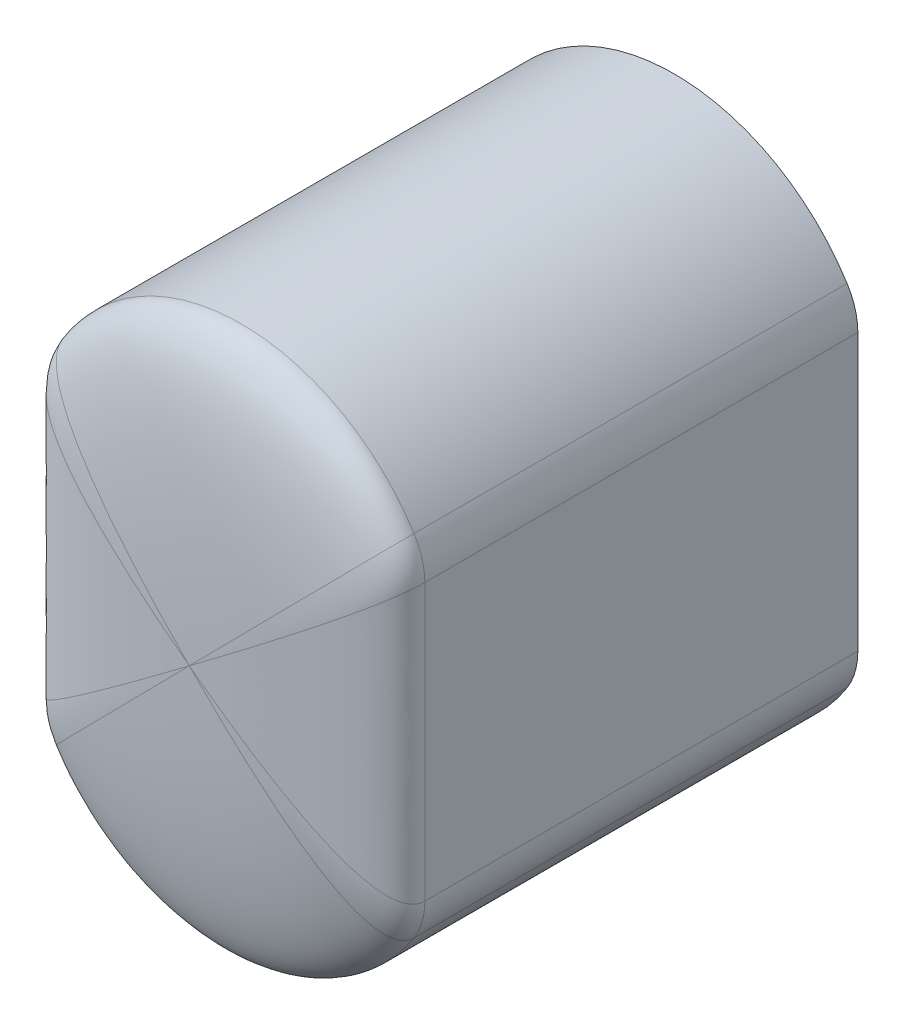
ISO-10303-21;
HEADER;
FILE_DESCRIPTION(('STEP AP214'),'2;1');
FILE_NAME('part.step','',(''),(''),'','','');
FILE_SCHEMA(('AUTOMOTIVE_DESIGN { 1 0 10303 214 1 1 1 1 }'));
ENDSEC;
DATA;
#1=APPLICATION_CONTEXT('core data for automotive mechanical design processes');
#2=APPLICATION_PROTOCOL_DEFINITION('international standard','automotive_design',2000,#1);
#3=PRODUCT_CONTEXT('',#1,'mechanical');
#4=PRODUCT('Part','Part','',(#3));
#5=PRODUCT_RELATED_PRODUCT_CATEGORY('part','',(#4));
#6=PRODUCT_DEFINITION_FORMATION('','',#4);
#7=PRODUCT_DEFINITION_CONTEXT('part definition',#1,'design');
#8=PRODUCT_DEFINITION('design','',#6,#7);
#9=PRODUCT_DEFINITION_SHAPE('','',#8);
#10=(LENGTH_UNIT() NAMED_UNIT(*) SI_UNIT(.MILLI.,.METRE.));
#11=(NAMED_UNIT(*) PLANE_ANGLE_UNIT() SI_UNIT($,.RADIAN.));
#12=(NAMED_UNIT(*) SI_UNIT($,.STERADIAN.) SOLID_ANGLE_UNIT());
#13=UNCERTAINTY_MEASURE_WITH_UNIT(LENGTH_MEASURE(1.E-05),#10,'distance_accuracy_value','');
#14=(GEOMETRIC_REPRESENTATION_CONTEXT(3) GLOBAL_UNCERTAINTY_ASSIGNED_CONTEXT((#13)) GLOBAL_UNIT_ASSIGNED_CONTEXT((#10,
#11,#12)) REPRESENTATION_CONTEXT('',''));
#15=CARTESIAN_POINT('',(0.,0.,0.));
#16=DIRECTION('',(0.,0.,1.));
#17=DIRECTION('',(1.,0.,0.));
#18=AXIS2_PLACEMENT_3D('',#15,#16,#17);
#19=CARTESIAN_POINT('',(6.60000000000001,-7.96750052110705,25.));
#20=DIRECTION('',(0.,0.,-1.));
#21=DIRECTION('',(-1.,0.,0.));
#22=AXIS2_PLACEMENT_3D('',#19,#20,#21);
#23=CYLINDRICAL_SURFACE('',#22,4.);
#24=CARTESIAN_POINT('',(6.60000000000001,-7.96750052110705,0.));
#25=DIRECTION('',(0.,0.,1.));
#26=DIRECTION('',(-1.,0.,0.));
#27=AXIS2_PLACEMENT_3D('',#24,#25,#26);
#28=CIRCLE('',#27,4.);
#29=CARTESIAN_POINT('',(9.97936384794416,-10.1075706094939,0.));
#30=VERTEX_POINT('',#29);
#31=CARTESIAN_POINT('',(10.6,-7.96750052110705,0.));
#32=VERTEX_POINT('',#31);
#33=EDGE_CURVE('E177',#30,#32,#28,.T.);
#34=ORIENTED_EDGE('',*,*,#33,.T.);
#35=DIRECTION('',(0.,0.,-1.));
#36=VECTOR('',#35,1.);
#37=CARTESIAN_POINT('',(10.6,-7.96750052110705,25.));
#38=LINE('',#37,#36);
#39=CARTESIAN_POINT('',(10.6,-7.96750052110705,25.));
#40=VERTEX_POINT('',#39);
#41=EDGE_CURVE('E11',#40,#32,#38,.T.);
#42=ORIENTED_EDGE('',*,*,#41,.F.);
#43=CARTESIAN_POINT('',(6.60000000000001,-7.96750052110705,25.));
#44=DIRECTION('',(0.,0.,1.));
#45=DIRECTION('',(-1.,0.,0.));
#46=AXIS2_PLACEMENT_3D('',#43,#44,#45);
#47=CIRCLE('',#46,4.);
#48=CARTESIAN_POINT('',(9.97936384794416,-10.1075706094939,25.));
#49=VERTEX_POINT('',#48);
#50=EDGE_CURVE('E178',#49,#40,#47,.T.);
#51=ORIENTED_EDGE('',*,*,#50,.F.);
#52=DIRECTION('',(0.,0.,-1.));
#53=VECTOR('',#52,1.);
#54=CARTESIAN_POINT('',(9.97936384794416,-10.1075706094939,25.));
#55=LINE('',#54,#53);
#56=EDGE_CURVE('E200',#49,#30,#55,.T.);
#57=ORIENTED_EDGE('',*,*,#56,.T.);
#58=EDGE_LOOP('',(#34,#42,#51,#57));
#59=FACE_BOUND('',#58,.T.);
#60=ADVANCED_FACE('F39',(#59),#23,.T.);
#61=CARTESIAN_POINT('',(10.6,7.96750052110705,25.));
#62=DIRECTION('',(-1.,0.,0.));
#63=DIRECTION('',(0.,0.,1.));
#64=AXIS2_PLACEMENT_3D('',#61,#62,#63);
#65=PLANE('',#64);
#66=DIRECTION('',(0.,1.,0.));
#67=VECTOR('',#66,1.);
#68=CARTESIAN_POINT('',(10.6,7.96750052110705,0.));
#69=LINE('',#68,#67);
#70=CARTESIAN_POINT('',(10.6,7.96750052110705,0.));
#71=VERTEX_POINT('',#70);
#72=EDGE_CURVE('E204',#32,#71,#69,.T.);
#73=ORIENTED_EDGE('',*,*,#72,.T.);
#74=DIRECTION('',(0.,0.,-1.));
#75=VECTOR('',#74,1.);
#76=CARTESIAN_POINT('',(10.6,7.96750052110705,25.));
#77=LINE('',#76,#75);
#78=CARTESIAN_POINT('',(10.6,7.96750052110705,25.));
#79=VERTEX_POINT('',#78);
#80=EDGE_CURVE('E48',#79,#71,#77,.T.);
#81=ORIENTED_EDGE('',*,*,#80,.F.);
#82=DIRECTION('',(0.,1.,0.));
#83=VECTOR('',#82,1.);
#84=CARTESIAN_POINT('',(10.6,7.96750052110705,25.));
#85=LINE('',#84,#83);
#86=EDGE_CURVE('E98',#40,#79,#85,.T.);
#87=ORIENTED_EDGE('',*,*,#86,.F.);
#88=ORIENTED_EDGE('',*,*,#41,.T.);
#89=EDGE_LOOP('',(#73,#81,#87,#88));
#90=FACE_BOUND('',#89,.T.);
#91=ADVANCED_FACE('F307',(#90),#65,.F.);
#92=CARTESIAN_POINT('',(6.60000000000001,7.96750052110705,25.));
#93=DIRECTION('',(0.,0.,-1.));
#94=DIRECTION('',(-1.,0.,0.));
#95=AXIS2_PLACEMENT_3D('',#92,#93,#94);
#96=CYLINDRICAL_SURFACE('',#95,4.);
#97=CARTESIAN_POINT('',(6.60000000000001,7.96750052110705,0.));
#98=DIRECTION('',(0.,0.,1.));
#99=DIRECTION('',(1.,0.,0.));
#100=AXIS2_PLACEMENT_3D('',#97,#98,#99);
#101=CIRCLE('',#100,4.);
#102=CARTESIAN_POINT('',(9.97936384794416,10.1075706094939,0.));
#103=VERTEX_POINT('',#102);
#104=EDGE_CURVE('E207',#71,#103,#101,.T.);
#105=ORIENTED_EDGE('',*,*,#104,.T.);
#106=DIRECTION('',(0.,0.,-1.));
#107=VECTOR('',#106,1.);
#108=CARTESIAN_POINT('',(9.97936384794416,10.1075706094939,25.));
#109=LINE('',#108,#107);
#110=CARTESIAN_POINT('',(9.97936384794416,10.1075706094939,25.));
#111=VERTEX_POINT('',#110);
#112=EDGE_CURVE('E230',#111,#103,#109,.T.);
#113=ORIENTED_EDGE('',*,*,#112,.F.);
#114=CARTESIAN_POINT('',(6.60000000000001,7.96750052110705,25.));
#115=DIRECTION('',(0.,0.,1.));
#116=DIRECTION('',(1.,0.,0.));
#117=AXIS2_PLACEMENT_3D('',#114,#115,#116);
#118=CIRCLE('',#117,4.);
#119=EDGE_CURVE('E187',#79,#111,#118,.T.);
#120=ORIENTED_EDGE('',*,*,#119,.F.);
#121=ORIENTED_EDGE('',*,*,#80,.T.);
#122=EDGE_LOOP('',(#105,#113,#120,#121));
#123=FACE_BOUND('',#122,.T.);
#124=ADVANCED_FACE('F238',(#123),#96,.T.);
#125=CARTESIAN_POINT('',(0.,3.78787878787879,25.));
#126=DIRECTION('',(0.,0.,-1.));
#127=DIRECTION('',(-1.,0.,0.));
#128=AXIS2_PLACEMENT_3D('',#125,#126,#127);
#129=CYLINDRICAL_SURFACE('',#128,11.8121212121212);
#130=CARTESIAN_POINT('',(0.,3.78787878787879,0.));
#131=DIRECTION('',(0.,0.,1.));
#132=DIRECTION('',(1.,0.,0.));
#133=AXIS2_PLACEMENT_3D('',#130,#131,#132);
#134=CIRCLE('',#133,11.8121212121212);
#135=CARTESIAN_POINT('',(-9.97936384794416,10.1075706094939,0.));
#136=VERTEX_POINT('',#135);
#137=EDGE_CURVE('E210',#103,#136,#134,.T.);
#138=ORIENTED_EDGE('',*,*,#137,.T.);
#139=DIRECTION('',(0.,0.,-1.));
#140=VECTOR('',#139,1.);
#141=CARTESIAN_POINT('',(-9.97936384794416,10.1075706094939,25.));
#142=LINE('',#141,#140);
#143=CARTESIAN_POINT('',(-9.97936384794416,10.1075706094939,25.));
#144=VERTEX_POINT('',#143);
#145=EDGE_CURVE('E125',#144,#136,#142,.T.);
#146=ORIENTED_EDGE('',*,*,#145,.F.);
#147=CARTESIAN_POINT('',(0.,3.78787878787879,25.));
#148=DIRECTION('',(0.,0.,1.));
#149=DIRECTION('',(1.,0.,0.));
#150=AXIS2_PLACEMENT_3D('',#147,#148,#149);
#151=CIRCLE('',#150,11.8121212121212);
#152=EDGE_CURVE('E146',#111,#144,#151,.T.);
#153=ORIENTED_EDGE('',*,*,#152,.F.);
#154=ORIENTED_EDGE('',*,*,#112,.T.);
#155=EDGE_LOOP('',(#138,#146,#153,#154));
#156=FACE_BOUND('',#155,.T.);
#157=ADVANCED_FACE('F244',(#156),#129,.T.);
#158=CARTESIAN_POINT('',(-6.60000000000001,7.96750052110705,25.));
#159=DIRECTION('',(0.,0.,-1.));
#160=DIRECTION('',(-1.,0.,0.));
#161=AXIS2_PLACEMENT_3D('',#158,#159,#160);
#162=CYLINDRICAL_SURFACE('',#161,4.);
#163=CARTESIAN_POINT('',(-6.60000000000001,7.96750052110705,0.));
#164=DIRECTION('',(0.,0.,1.));
#165=DIRECTION('',(-1.,0.,0.));
#166=AXIS2_PLACEMENT_3D('',#163,#164,#165);
#167=CIRCLE('',#166,4.);
#168=CARTESIAN_POINT('',(-10.6,7.96750052110705,0.));
#169=VERTEX_POINT('',#168);
#170=EDGE_CURVE('E121',#136,#169,#167,.T.);
#171=ORIENTED_EDGE('',*,*,#170,.T.);
#172=DIRECTION('',(0.,0.,-1.));
#173=VECTOR('',#172,1.);
#174=CARTESIAN_POINT('',(-10.6,7.96750052110705,25.));
#175=LINE('',#174,#173);
#176=CARTESIAN_POINT('',(-10.6,7.96750052110705,25.));
#177=VERTEX_POINT('',#176);
#178=EDGE_CURVE('E113',#177,#169,#175,.T.);
#179=ORIENTED_EDGE('',*,*,#178,.F.);
#180=CARTESIAN_POINT('',(-6.60000000000001,7.96750052110705,25.));
#181=DIRECTION('',(0.,0.,1.));
#182=DIRECTION('',(-1.,0.,0.));
#183=AXIS2_PLACEMENT_3D('',#180,#181,#182);
#184=CIRCLE('',#183,4.);
#185=EDGE_CURVE('E118',#144,#177,#184,.T.);
#186=ORIENTED_EDGE('',*,*,#185,.F.);
#187=ORIENTED_EDGE('',*,*,#145,.T.);
#188=EDGE_LOOP('',(#171,#179,#186,#187));
#189=FACE_BOUND('',#188,.T.);
#190=ADVANCED_FACE('F115',(#189),#162,.T.);
#191=CARTESIAN_POINT('',(-10.6,7.96750052110705,25.));
#192=DIRECTION('',(1.,0.,0.));
#193=DIRECTION('',(0.,0.,-1.));
#194=AXIS2_PLACEMENT_3D('',#191,#192,#193);
#195=PLANE('',#194);
#196=DIRECTION('',(0.,-1.,0.));
#197=VECTOR('',#196,1.);
#198=CARTESIAN_POINT('',(-10.6,7.96750052110705,0.));
#199=LINE('',#198,#197);
#200=CARTESIAN_POINT('',(-10.6,-7.96750052110705,0.));
#201=VERTEX_POINT('',#200);
#202=EDGE_CURVE('E215',#169,#201,#199,.T.);
#203=ORIENTED_EDGE('',*,*,#202,.T.);
#204=DIRECTION('',(0.,0.,-1.));
#205=VECTOR('',#204,1.);
#206=CARTESIAN_POINT('',(-10.6,-7.96750052110705,25.));
#207=LINE('',#206,#205);
#208=CARTESIAN_POINT('',(-10.6,-7.96750052110705,25.));
#209=VERTEX_POINT('',#208);
#210=EDGE_CURVE('E126',#209,#201,#207,.T.);
#211=ORIENTED_EDGE('',*,*,#210,.F.);
#212=DIRECTION('',(0.,-1.,0.));
#213=VECTOR('',#212,1.);
#214=CARTESIAN_POINT('',(-10.6,7.96750052110705,25.));
#215=LINE('',#214,#213);
#216=EDGE_CURVE('E129',#177,#209,#215,.T.);
#217=ORIENTED_EDGE('',*,*,#216,.F.);
#218=ORIENTED_EDGE('',*,*,#178,.T.);
#219=EDGE_LOOP('',(#203,#211,#217,#218));
#220=FACE_BOUND('',#219,.T.);
#221=ADVANCED_FACE('F130',(#220),#195,.F.);
#222=CARTESIAN_POINT('',(-6.60000000000001,-7.96750052110705,25.));
#223=DIRECTION('',(0.,0.,-1.));
#224=DIRECTION('',(-1.,0.,0.));
#225=AXIS2_PLACEMENT_3D('',#222,#223,#224);
#226=CYLINDRICAL_SURFACE('',#225,4.);
#227=CARTESIAN_POINT('',(-6.60000000000001,-7.96750052110705,0.));
#228=DIRECTION('',(0.,0.,1.));
#229=DIRECTION('',(1.,0.,0.));
#230=AXIS2_PLACEMENT_3D('',#227,#228,#229);
#231=CIRCLE('',#230,4.);
#232=CARTESIAN_POINT('',(-9.97936384794416,-10.1075706094939,0.));
#233=VERTEX_POINT('',#232);
#234=EDGE_CURVE('E84',#201,#233,#231,.T.);
#235=ORIENTED_EDGE('',*,*,#234,.T.);
#236=DIRECTION('',(0.,0.,-1.));
#237=VECTOR('',#236,1.);
#238=CARTESIAN_POINT('',(-9.97936384794416,-10.1075706094939,25.));
#239=LINE('',#238,#237);
#240=CARTESIAN_POINT('',(-9.97936384794416,-10.1075706094939,25.));
#241=VERTEX_POINT('',#240);
#242=EDGE_CURVE('E56',#241,#233,#239,.T.);
#243=ORIENTED_EDGE('',*,*,#242,.F.);
#244=CARTESIAN_POINT('',(-6.60000000000001,-7.96750052110705,25.));
#245=DIRECTION('',(0.,0.,1.));
#246=DIRECTION('',(1.,0.,0.));
#247=AXIS2_PLACEMENT_3D('',#244,#245,#246);
#248=CIRCLE('',#247,4.);
#249=EDGE_CURVE('E136',#209,#241,#248,.T.);
#250=ORIENTED_EDGE('',*,*,#249,.F.);
#251=ORIENTED_EDGE('',*,*,#210,.T.);
#252=EDGE_LOOP('',(#235,#243,#250,#251));
#253=FACE_BOUND('',#252,.T.);
#254=ADVANCED_FACE('F312',(#253),#226,.T.);
#255=CARTESIAN_POINT('',(0.,-3.78787878787879,25.));
#256=DIRECTION('',(0.,0.,-1.));
#257=DIRECTION('',(-1.,0.,0.));
#258=AXIS2_PLACEMENT_3D('',#255,#256,#257);
#259=CYLINDRICAL_SURFACE('',#258,11.8121212121212);
#260=CARTESIAN_POINT('',(0.,-3.78787878787879,0.));
#261=DIRECTION('',(0.,0.,1.));
#262=DIRECTION('',(1.,0.,0.));
#263=AXIS2_PLACEMENT_3D('',#260,#261,#262);
#264=CIRCLE('',#263,11.8121212121212);
#265=EDGE_CURVE('E90',#233,#30,#264,.T.);
#266=ORIENTED_EDGE('',*,*,#265,.T.);
#267=ORIENTED_EDGE('',*,*,#56,.F.);
#268=CARTESIAN_POINT('',(0.,-3.78787878787879,25.));
#269=DIRECTION('',(0.,0.,1.));
#270=DIRECTION('',(1.,0.,0.));
#271=AXIS2_PLACEMENT_3D('',#268,#269,#270);
#272=CIRCLE('',#271,11.8121212121212);
#273=EDGE_CURVE('E196',#241,#49,#272,.T.);
#274=ORIENTED_EDGE('',*,*,#273,.F.);
#275=ORIENTED_EDGE('',*,*,#242,.T.);
#276=EDGE_LOOP('',(#266,#267,#274,#275));
#277=FACE_BOUND('',#276,.T.);
#278=ADVANCED_FACE('F316',(#277),#259,.T.);
#279=CARTESIAN_POINT('',(6.60000000000001,-7.96750052110705,0.));
#280=DIRECTION('',(0.,0.,-1.));
#281=DIRECTION('',(-1.,0.,0.));
#282=AXIS2_PLACEMENT_3D('',#279,#280,#281);
#283=PLANE('',#282);
#284=ORIENTED_EDGE('',*,*,#33,.F.);
#285=ORIENTED_EDGE('',*,*,#265,.F.);
#286=ORIENTED_EDGE('',*,*,#234,.F.);
#287=ORIENTED_EDGE('',*,*,#202,.F.);
#288=ORIENTED_EDGE('',*,*,#170,.F.);
#289=ORIENTED_EDGE('',*,*,#137,.F.);
#290=ORIENTED_EDGE('',*,*,#104,.F.);
#291=ORIENTED_EDGE('',*,*,#72,.F.);
#292=EDGE_LOOP('',(#284,#285,#286,#287,#288,#289,#290,#291));
#293=FACE_BOUND('',#292,.T.);
#294=ADVANCED_FACE('F242',(#293),#283,.T.);
#295=CARTESIAN_POINT('',(9.97936384794416,-10.1075706094939,25.));
#296=CARTESIAN_POINT('',(9.97936384794416,-10.1075706094939,28.));
#297=CARTESIAN_POINT('',(0.,0.,28.));
#298=CARTESIAN_POINT('',(10.3875155517594,-9.46306222641105,25.));
#299=CARTESIAN_POINT('',(10.3875155517594,-9.46306222641105,28.));
#300=CARTESIAN_POINT('',(0.,0.,28.));
#301=CARTESIAN_POINT('',(10.6,-8.73037591669364,25.));
#302=CARTESIAN_POINT('',(10.6,-8.73037591669364,28.));
#303=CARTESIAN_POINT('',(0.,0.,28.));
#304=CARTESIAN_POINT('',(10.6,-7.96750052110705,25.));
#305=CARTESIAN_POINT('',(10.6,-7.96750052110705,28.));
#306=CARTESIAN_POINT('',(0.,0.,28.));
#307=(BOUNDED_SURFACE() B_SPLINE_SURFACE(3,2,((#295,#296,#297),(#298,#299,#300),(#301,#302,
#303),(#304,#305,#306)),.UNSPECIFIED.,.F.,.F.,.F.) B_SPLINE_SURFACE_WITH_KNOTS((4,4),(3,3),(0.,
1.),(0.,1.),.UNSPECIFIED.) GEOMETRIC_REPRESENTATION_ITEM() RATIONAL_B_SPLINE_SURFACE(((1.,1.,
1.),(0.973618159187515,0.973618159187515,0.973618159187515),(0.973618159187515,
0.973618159187515,0.973618159187515),(1.,1.,1.))) REPRESENTATION_ITEM('') SURFACE());
#308=CARTESIAN_POINT('',(10.6,-7.96750052110705,25.));
#309=CARTESIAN_POINT('',(10.6,-7.96750052110705,28.));
#310=CARTESIAN_POINT('',(0.,0.,28.));
#311=(BOUNDED_CURVE() B_SPLINE_CURVE(2,(#308,#309,#310),.UNSPECIFIED.,.F.,
.F.) B_SPLINE_CURVE_WITH_KNOTS((3,3),(0.,1.),
.UNSPECIFIED.) CURVE() GEOMETRIC_REPRESENTATION_ITEM() RATIONAL_B_SPLINE_CURVE((1.,1.,1.)) REPRESENTATION_ITEM(''));
#312=CARTESIAN_POINT('',(0.,0.,28.));
#313=VERTEX_POINT('',#312);
#314=EDGE_CURVE('E257',#40,#313,#311,.T.);
#315=CARTESIAN_POINT('',(9.97936384794416,-10.1075706094939,25.));
#316=CARTESIAN_POINT('',(9.97936384794416,-10.1075706094939,28.));
#317=CARTESIAN_POINT('',(0.,0.,28.));
#318=(BOUNDED_CURVE() B_SPLINE_CURVE(2,(#315,#316,#317),.UNSPECIFIED.,.F.,
.F.) B_SPLINE_CURVE_WITH_KNOTS((3,3),(0.,1.),
.UNSPECIFIED.) CURVE() GEOMETRIC_REPRESENTATION_ITEM() RATIONAL_B_SPLINE_CURVE((1.,1.,1.)) REPRESENTATION_ITEM(''));
#319=EDGE_CURVE('E267',#313,#49,#318,.F.);
#320=ORIENTED_EDGE('',*,*,#50,.T.);
#321=ORIENTED_EDGE('',*,*,#314,.T.);
#322=ORIENTED_EDGE('',*,*,#319,.T.);
#323=EDGE_LOOP('',(#320,#321,#322));
#324=FACE_BOUND('',#323,.T.);
#325=ADVANCED_FACE('F288',(#324),#307,.T.);
#326=CARTESIAN_POINT('',(10.6,-7.96750052110705,25.));
#327=CARTESIAN_POINT('',(10.6,-7.96750052110705,28.));
#328=CARTESIAN_POINT('',(0.,0.,28.));
#329=CARTESIAN_POINT('',(10.6,7.96750052110705,25.));
#330=CARTESIAN_POINT('',(10.6,7.96750052110705,28.));
#331=CARTESIAN_POINT('',(0.,0.,28.));
#332=(BOUNDED_SURFACE() B_SPLINE_SURFACE(1,2,((#326,#327,#328),(#329,#330,#331)),.UNSPECIFIED.,
.F.,.F.,.F.) B_SPLINE_SURFACE_WITH_KNOTS((2,2),(3,3),(0.,1.),(0.,1.),
.UNSPECIFIED.) GEOMETRIC_REPRESENTATION_ITEM() RATIONAL_B_SPLINE_SURFACE(((1.,1.,1.),(1.,1.,1.))) REPRESENTATION_ITEM('') SURFACE());
#333=CARTESIAN_POINT('',(10.6,7.96750052110705,25.));
#334=CARTESIAN_POINT('',(10.6,7.96750052110705,28.));
#335=CARTESIAN_POINT('',(0.,0.,28.));
#336=(BOUNDED_CURVE() B_SPLINE_CURVE(2,(#333,#334,#335),.UNSPECIFIED.,.F.,
.F.) B_SPLINE_CURVE_WITH_KNOTS((3,3),(0.,1.),
.UNSPECIFIED.) CURVE() GEOMETRIC_REPRESENTATION_ITEM() RATIONAL_B_SPLINE_CURVE((1.,1.,1.)) REPRESENTATION_ITEM(''));
#337=EDGE_CURVE('E253',#79,#313,#336,.T.);
#338=ORIENTED_EDGE('',*,*,#86,.T.);
#339=ORIENTED_EDGE('',*,*,#337,.T.);
#340=ORIENTED_EDGE('',*,*,#314,.F.);
#341=EDGE_LOOP('',(#338,#339,#340));
#342=FACE_BOUND('',#341,.T.);
#343=ADVANCED_FACE('F293',(#342),#332,.T.);
#344=CARTESIAN_POINT('',(-9.97936384794416,-10.1075706094939,25.));
#345=CARTESIAN_POINT('',(-9.97936384794416,-10.1075706094939,28.));
#346=CARTESIAN_POINT('',(0.,0.,28.));
#347=CARTESIAN_POINT('',(-4.82086710364489,-18.2533026123943,25.));
#348=CARTESIAN_POINT('',(-4.82086710364489,-18.2533026123943,28.));
#349=CARTESIAN_POINT('',(0.,0.,28.));
#350=CARTESIAN_POINT('',(4.82086710364488,-18.2533026123943,25.));
#351=CARTESIAN_POINT('',(4.82086710364488,-18.2533026123943,28.));
#352=CARTESIAN_POINT('',(0.,0.,28.));
#353=CARTESIAN_POINT('',(9.97936384794416,-10.1075706094939,25.));
#354=CARTESIAN_POINT('',(9.97936384794416,-10.1075706094939,28.));
#355=CARTESIAN_POINT('',(0.,0.,28.));
#356=(BOUNDED_SURFACE() B_SPLINE_SURFACE(3,2,((#344,#345,#346),(#347,#348,#349),(#350,#351,
#352),(#353,#354,#355)),.UNSPECIFIED.,.F.,.F.,.F.) B_SPLINE_SURFACE_WITH_KNOTS((4,4),(3,3),(0.,
1.),(0.,1.),.UNSPECIFIED.) GEOMETRIC_REPRESENTATION_ITEM() RATIONAL_B_SPLINE_SURFACE(((1.,1.,
1.),(0.690011681397808,0.690011681397808,0.690011681397808),(0.690011681397808,
0.690011681397808,0.690011681397808),(1.,1.,1.))) REPRESENTATION_ITEM('') SURFACE());
#357=CARTESIAN_POINT('',(-9.97936384794416,-10.1075706094939,25.));
#358=CARTESIAN_POINT('',(-9.97936384794416,-10.1075706094939,28.));
#359=CARTESIAN_POINT('',(0.,0.,28.));
#360=(BOUNDED_CURVE() B_SPLINE_CURVE(2,(#357,#358,#359),.UNSPECIFIED.,.F.,
.F.) B_SPLINE_CURVE_WITH_KNOTS((3,3),(0.,1.),
.UNSPECIFIED.) CURVE() GEOMETRIC_REPRESENTATION_ITEM() RATIONAL_B_SPLINE_CURVE((1.,1.,1.)) REPRESENTATION_ITEM(''));
#361=EDGE_CURVE('E155',#241,#313,#360,.T.);
#362=ORIENTED_EDGE('',*,*,#273,.T.);
#363=ORIENTED_EDGE('',*,*,#319,.F.);
#364=ORIENTED_EDGE('',*,*,#361,.F.);
#365=EDGE_LOOP('',(#362,#363,#364));
#366=FACE_BOUND('',#365,.T.);
#367=ADVANCED_FACE('F295',(#366),#356,.T.);
#368=CARTESIAN_POINT('',(10.6,7.96750052110705,25.));
#369=CARTESIAN_POINT('',(10.6,7.96750052110705,28.));
#370=CARTESIAN_POINT('',(0.,0.,28.));
#371=CARTESIAN_POINT('',(10.6,8.73037591669364,25.));
#372=CARTESIAN_POINT('',(10.6,8.73037591669364,28.));
#373=CARTESIAN_POINT('',(0.,0.,28.));
#374=CARTESIAN_POINT('',(10.3875155517595,9.46306222641104,25.));
#375=CARTESIAN_POINT('',(10.3875155517595,9.46306222641104,28.));
#376=CARTESIAN_POINT('',(0.,0.,28.));
#377=CARTESIAN_POINT('',(9.97936384794416,10.1075706094939,25.));
#378=CARTESIAN_POINT('',(9.97936384794416,10.1075706094939,28.));
#379=CARTESIAN_POINT('',(0.,0.,28.));
#380=(BOUNDED_SURFACE() B_SPLINE_SURFACE(3,2,((#368,#369,#370),(#371,#372,#373),(#374,#375,
#376),(#377,#378,#379)),.UNSPECIFIED.,.F.,.F.,.F.) B_SPLINE_SURFACE_WITH_KNOTS((4,4),(3,3),(0.,
1.),(0.,1.),.UNSPECIFIED.) GEOMETRIC_REPRESENTATION_ITEM() RATIONAL_B_SPLINE_SURFACE(((1.,1.,
1.),(0.973618159187515,0.973618159187515,0.973618159187515),(0.973618159187515,
0.973618159187515,0.973618159187515),(1.,1.,1.))) REPRESENTATION_ITEM('') SURFACE());
#381=CARTESIAN_POINT('',(9.97936384794416,10.1075706094939,25.));
#382=CARTESIAN_POINT('',(9.97936384794416,10.1075706094939,28.));
#383=CARTESIAN_POINT('',(0.,0.,28.));
#384=(BOUNDED_CURVE() B_SPLINE_CURVE(2,(#381,#382,#383),.UNSPECIFIED.,.F.,
.F.) B_SPLINE_CURVE_WITH_KNOTS((3,3),(0.,1.),
.UNSPECIFIED.) CURVE() GEOMETRIC_REPRESENTATION_ITEM() RATIONAL_B_SPLINE_CURVE((1.,1.,1.)) REPRESENTATION_ITEM(''));
#385=EDGE_CURVE('E157',#111,#313,#384,.T.);
#386=ORIENTED_EDGE('',*,*,#119,.T.);
#387=ORIENTED_EDGE('',*,*,#385,.T.);
#388=ORIENTED_EDGE('',*,*,#337,.F.);
#389=EDGE_LOOP('',(#386,#387,#388));
#390=FACE_BOUND('',#389,.T.);
#391=ADVANCED_FACE('F251',(#390),#380,.T.);
#392=CARTESIAN_POINT('',(9.97936384794416,10.1075706094939,25.));
#393=CARTESIAN_POINT('',(9.97936384794416,10.1075706094939,28.));
#394=CARTESIAN_POINT('',(0.,0.,28.));
#395=CARTESIAN_POINT('',(4.82086710364488,18.2533026123943,25.));
#396=CARTESIAN_POINT('',(4.82086710364488,18.2533026123943,28.));
#397=CARTESIAN_POINT('',(0.,0.,28.));
#398=CARTESIAN_POINT('',(-4.82086710364488,18.2533026123943,25.));
#399=CARTESIAN_POINT('',(-4.82086710364488,18.2533026123943,28.));
#400=CARTESIAN_POINT('',(0.,0.,28.));
#401=CARTESIAN_POINT('',(-9.97936384794416,10.1075706094939,25.));
#402=CARTESIAN_POINT('',(-9.97936384794416,10.1075706094939,28.));
#403=CARTESIAN_POINT('',(0.,0.,28.));
#404=(BOUNDED_SURFACE() B_SPLINE_SURFACE(3,2,((#392,#393,#394),(#395,#396,#397),(#398,#399,
#400),(#401,#402,#403)),.UNSPECIFIED.,.F.,.F.,.F.) B_SPLINE_SURFACE_WITH_KNOTS((4,4),(3,3),(0.,
1.),(0.,1.),.UNSPECIFIED.) GEOMETRIC_REPRESENTATION_ITEM() RATIONAL_B_SPLINE_SURFACE(((1.,1.,
1.),(0.690011681397809,0.690011681397809,0.690011681397809),(0.690011681397809,
0.690011681397809,0.690011681397809),(1.,1.,1.))) REPRESENTATION_ITEM('') SURFACE());
#405=CARTESIAN_POINT('',(-9.97936384794416,10.1075706094939,25.));
#406=CARTESIAN_POINT('',(-9.97936384794416,10.1075706094939,28.));
#407=CARTESIAN_POINT('',(0.,0.,28.));
#408=(BOUNDED_CURVE() B_SPLINE_CURVE(2,(#405,#406,#407),.UNSPECIFIED.,.F.,
.F.) B_SPLINE_CURVE_WITH_KNOTS((3,3),(0.,1.),
.UNSPECIFIED.) CURVE() GEOMETRIC_REPRESENTATION_ITEM() RATIONAL_B_SPLINE_CURVE((1.,1.,1.)) REPRESENTATION_ITEM(''));
#409=EDGE_CURVE('E144',#144,#313,#408,.T.);
#410=ORIENTED_EDGE('',*,*,#152,.T.);
#411=ORIENTED_EDGE('',*,*,#409,.T.);
#412=ORIENTED_EDGE('',*,*,#385,.F.);
#413=EDGE_LOOP('',(#410,#411,#412));
#414=FACE_BOUND('',#413,.T.);
#415=ADVANCED_FACE('F254',(#414),#404,.T.);
#416=CARTESIAN_POINT('',(-9.97936384794416,10.1075706094939,25.));
#417=CARTESIAN_POINT('',(-9.97936384794416,10.1075706094939,28.));
#418=CARTESIAN_POINT('',(0.,0.,28.));
#419=CARTESIAN_POINT('',(-10.3875155517594,9.46306222641105,25.));
#420=CARTESIAN_POINT('',(-10.3875155517594,9.46306222641105,28.));
#421=CARTESIAN_POINT('',(0.,0.,28.));
#422=CARTESIAN_POINT('',(-10.6,8.73037591669364,25.));
#423=CARTESIAN_POINT('',(-10.6,8.73037591669364,28.));
#424=CARTESIAN_POINT('',(0.,0.,28.));
#425=CARTESIAN_POINT('',(-10.6,7.96750052110705,25.));
#426=CARTESIAN_POINT('',(-10.6,7.96750052110705,28.));
#427=CARTESIAN_POINT('',(0.,0.,28.));
#428=(BOUNDED_SURFACE() B_SPLINE_SURFACE(3,2,((#416,#417,#418),(#419,#420,#421),(#422,#423,
#424),(#425,#426,#427)),.UNSPECIFIED.,.F.,.F.,.F.) B_SPLINE_SURFACE_WITH_KNOTS((4,4),(3,3),(0.,
1.),(0.,1.),.UNSPECIFIED.) GEOMETRIC_REPRESENTATION_ITEM() RATIONAL_B_SPLINE_SURFACE(((1.,1.,
1.),(0.973618159187515,0.973618159187515,0.973618159187515),(0.973618159187515,
0.973618159187515,0.973618159187515),(1.,1.,1.))) REPRESENTATION_ITEM('') SURFACE());
#429=CARTESIAN_POINT('',(-10.6,7.96750052110705,25.));
#430=CARTESIAN_POINT('',(-10.6,7.96750052110705,28.));
#431=CARTESIAN_POINT('',(0.,0.,28.));
#432=(BOUNDED_CURVE() B_SPLINE_CURVE(2,(#429,#430,#431),.UNSPECIFIED.,.F.,
.F.) B_SPLINE_CURVE_WITH_KNOTS((3,3),(0.,1.),
.UNSPECIFIED.) CURVE() GEOMETRIC_REPRESENTATION_ITEM() RATIONAL_B_SPLINE_CURVE((1.,1.,1.)) REPRESENTATION_ITEM(''));
#433=EDGE_CURVE('E142',#177,#313,#432,.T.);
#434=ORIENTED_EDGE('',*,*,#185,.T.);
#435=ORIENTED_EDGE('',*,*,#433,.T.);
#436=ORIENTED_EDGE('',*,*,#409,.F.);
#437=EDGE_LOOP('',(#434,#435,#436));
#438=FACE_BOUND('',#437,.T.);
#439=ADVANCED_FACE('F141',(#438),#428,.T.);
#440=CARTESIAN_POINT('',(-10.6,7.96750052110705,25.));
#441=CARTESIAN_POINT('',(-10.6,7.96750052110705,28.));
#442=CARTESIAN_POINT('',(0.,0.,28.));
#443=CARTESIAN_POINT('',(-10.6,-7.96750052110705,25.));
#444=CARTESIAN_POINT('',(-10.6,-7.96750052110705,28.));
#445=CARTESIAN_POINT('',(0.,0.,28.));
#446=(BOUNDED_SURFACE() B_SPLINE_SURFACE(1,2,((#440,#441,#442),(#443,#444,#445)),.UNSPECIFIED.,
.F.,.F.,.F.) B_SPLINE_SURFACE_WITH_KNOTS((2,2),(3,3),(0.,1.),(0.,1.),
.UNSPECIFIED.) GEOMETRIC_REPRESENTATION_ITEM() RATIONAL_B_SPLINE_SURFACE(((1.,1.,1.),(1.,1.,1.))) REPRESENTATION_ITEM('') SURFACE());
#447=CARTESIAN_POINT('',(-10.6,-7.96750052110705,25.));
#448=CARTESIAN_POINT('',(-10.6,-7.96750052110705,28.));
#449=CARTESIAN_POINT('',(0.,0.,28.));
#450=(BOUNDED_CURVE() B_SPLINE_CURVE(2,(#447,#448,#449),.UNSPECIFIED.,.F.,
.F.) B_SPLINE_CURVE_WITH_KNOTS((3,3),(0.,1.),
.UNSPECIFIED.) CURVE() GEOMETRIC_REPRESENTATION_ITEM() RATIONAL_B_SPLINE_CURVE((1.,1.,1.)) REPRESENTATION_ITEM(''));
#451=EDGE_CURVE('E149',#209,#313,#450,.T.);
#452=ORIENTED_EDGE('',*,*,#216,.T.);
#453=ORIENTED_EDGE('',*,*,#451,.T.);
#454=ORIENTED_EDGE('',*,*,#433,.F.);
#455=EDGE_LOOP('',(#452,#453,#454));
#456=FACE_BOUND('',#455,.T.);
#457=ADVANCED_FACE('F148',(#456),#446,.T.);
#458=CARTESIAN_POINT('',(-10.6,-7.96750052110705,25.));
#459=CARTESIAN_POINT('',(-10.6,-7.96750052110705,28.));
#460=CARTESIAN_POINT('',(0.,0.,28.));
#461=CARTESIAN_POINT('',(-10.6,-8.73037591669364,25.));
#462=CARTESIAN_POINT('',(-10.6,-8.73037591669364,28.));
#463=CARTESIAN_POINT('',(0.,0.,28.));
#464=CARTESIAN_POINT('',(-10.3875155517594,-9.46306222641104,25.));
#465=CARTESIAN_POINT('',(-10.3875155517594,-9.46306222641104,28.));
#466=CARTESIAN_POINT('',(0.,0.,28.));
#467=CARTESIAN_POINT('',(-9.97936384794416,-10.1075706094939,25.));
#468=CARTESIAN_POINT('',(-9.97936384794416,-10.1075706094939,28.));
#469=CARTESIAN_POINT('',(0.,0.,28.));
#470=(BOUNDED_SURFACE() B_SPLINE_SURFACE(3,2,((#458,#459,#460),(#461,#462,#463),(#464,#465,
#466),(#467,#468,#469)),.UNSPECIFIED.,.F.,.F.,.F.) B_SPLINE_SURFACE_WITH_KNOTS((4,4),(3,3),(0.,
1.),(0.,1.),.UNSPECIFIED.) GEOMETRIC_REPRESENTATION_ITEM() RATIONAL_B_SPLINE_SURFACE(((1.,1.,
1.),(0.973618159187515,0.973618159187515,0.973618159187515),(0.973618159187515,
0.973618159187515,0.973618159187515),(1.,1.,1.))) REPRESENTATION_ITEM('') SURFACE());
#471=ORIENTED_EDGE('',*,*,#249,.T.);
#472=ORIENTED_EDGE('',*,*,#361,.T.);
#473=ORIENTED_EDGE('',*,*,#451,.F.);
#474=EDGE_LOOP('',(#471,#472,#473));
#475=FACE_BOUND('',#474,.T.);
#476=ADVANCED_FACE('F315',(#475),#470,.T.);
#477=CLOSED_SHELL('',(#60,#91,#124,#157,#190,#221,#254,#278,#294,#325,#343,#367,#391,#415,#439,
#457,#476));
#478=MANIFOLD_SOLID_BREP('B2',#477);
#479=ADVANCED_BREP_SHAPE_REPRESENTATION('',(#18,#478),#14);
#480=SHAPE_DEFINITION_REPRESENTATION(#9,#479);
ENDSEC;
END-ISO-10303-21;
